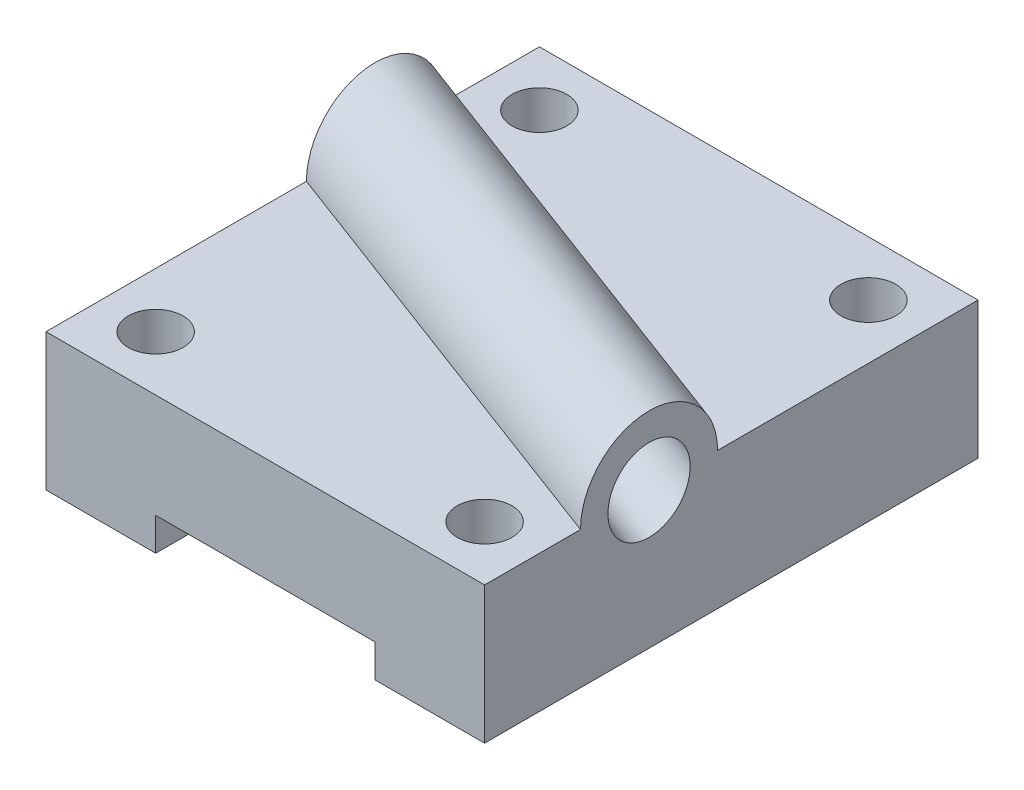
ISO-10303-21;
HEADER;
FILE_DESCRIPTION(('STEP AP214'),'2;1');
FILE_NAME('part.step','',(''),(''),'','','');
FILE_SCHEMA(('AUTOMOTIVE_DESIGN { 1 0 10303 214 1 1 1 1 }'));
ENDSEC;
DATA;
#1=APPLICATION_CONTEXT('core data for automotive mechanical design processes');
#2=APPLICATION_PROTOCOL_DEFINITION('international standard','automotive_design',2000,#1);
#3=PRODUCT_CONTEXT('',#1,'mechanical');
#4=PRODUCT('Part','Part','',(#3));
#5=PRODUCT_RELATED_PRODUCT_CATEGORY('part','',(#4));
#6=PRODUCT_DEFINITION_FORMATION('','',#4);
#7=PRODUCT_DEFINITION_CONTEXT('part definition',#1,'design');
#8=PRODUCT_DEFINITION('design','',#6,#7);
#9=PRODUCT_DEFINITION_SHAPE('','',#8);
#10=(LENGTH_UNIT() NAMED_UNIT(*) SI_UNIT(.MILLI.,.METRE.));
#11=(NAMED_UNIT(*) PLANE_ANGLE_UNIT() SI_UNIT($,.RADIAN.));
#12=(NAMED_UNIT(*) SI_UNIT($,.STERADIAN.) SOLID_ANGLE_UNIT());
#13=UNCERTAINTY_MEASURE_WITH_UNIT(LENGTH_MEASURE(1.E-05),#10,'distance_accuracy_value','');
#14=(GEOMETRIC_REPRESENTATION_CONTEXT(3) GLOBAL_UNCERTAINTY_ASSIGNED_CONTEXT((#13)) GLOBAL_UNIT_ASSIGNED_CONTEXT((#10,
#11,#12)) REPRESENTATION_CONTEXT('',''));
#15=CARTESIAN_POINT('',(0.,0.,0.));
#16=DIRECTION('',(0.,0.,1.));
#17=DIRECTION('',(1.,0.,0.));
#18=AXIS2_PLACEMENT_3D('',#15,#16,#17);
#19=CARTESIAN_POINT('',(0.,25.,-90.));
#20=DIRECTION('',(0.,1.,0.));
#21=DIRECTION('',(-1.,0.,0.));
#22=AXIS2_PLACEMENT_3D('',#19,#20,#21);
#23=PLANE('',#22);
#24=DIRECTION('',(-0.936329177569045,0.,-0.351123441588392));
#25=VECTOR('',#24,1.);
#26=CARTESIAN_POINT('',(-40.,25.,-57.5));
#27=LINE('',#26,#25);
#28=CARTESIAN_POINT('',(0.,25.,-42.5));
#29=VERTEX_POINT('',#28);
#30=CARTESIAN_POINT('',(-80.,25.,-72.5));
#31=VERTEX_POINT('',#30);
#32=EDGE_CURVE('E294',#29,#31,#27,.T.);
#33=ORIENTED_EDGE('',*,*,#32,.F.);
#34=DIRECTION('',(0.,0.,1.));
#35=VECTOR('',#34,1.);
#36=CARTESIAN_POINT('',(0.,25.,-90.));
#37=LINE('',#36,#35);
#38=CARTESIAN_POINT('',(0.,25.,-90.));
#39=VERTEX_POINT('',#38);
#40=EDGE_CURVE('E214',#39,#29,#37,.T.);
#41=ORIENTED_EDGE('',*,*,#40,.F.);
#42=DIRECTION('',(-1.,0.,0.));
#43=VECTOR('',#42,1.);
#44=CARTESIAN_POINT('',(0.,25.,-90.));
#45=LINE('',#44,#43);
#46=CARTESIAN_POINT('',(-80.,25.,-90.));
#47=VERTEX_POINT('',#46);
#48=EDGE_CURVE('E283',#39,#47,#45,.T.);
#49=ORIENTED_EDGE('',*,*,#48,.T.);
#50=DIRECTION('',(0.,0.,1.));
#51=VECTOR('',#50,1.);
#52=CARTESIAN_POINT('',(-80.,25.,-90.));
#53=LINE('',#52,#51);
#54=EDGE_CURVE('E200',#47,#31,#53,.T.);
#55=ORIENTED_EDGE('',*,*,#54,.T.);
#56=EDGE_LOOP('',(#33,#41,#49,#55));
#57=FACE_BOUND('',#56,.T.);
#58=CARTESIAN_POINT('',(-70.,25.,-80.));
#59=DIRECTION('',(0.,1.,0.));
#60=DIRECTION('',(-1.,0.,0.));
#61=AXIS2_PLACEMENT_3D('',#58,#59,#60);
#62=CIRCLE('',#61,5.00000000000001);
#63=CARTESIAN_POINT('',(-75.,25.,-80.));
#64=VERTEX_POINT('',#63);
#65=EDGE_CURVE('E177',#64,#64,#62,.T.);
#66=ORIENTED_EDGE('',*,*,#65,.F.);
#67=EDGE_LOOP('',(#66));
#68=FACE_BOUND('',#67,.T.);
#69=CARTESIAN_POINT('',(-10.,25.,-80.));
#70=DIRECTION('',(0.,1.,0.));
#71=DIRECTION('',(-1.,0.,0.));
#72=AXIS2_PLACEMENT_3D('',#69,#70,#71);
#73=CIRCLE('',#72,5.00000000000001);
#74=CARTESIAN_POINT('',(-15.,25.,-80.));
#75=VERTEX_POINT('',#74);
#76=EDGE_CURVE('E265',#75,#75,#73,.T.);
#77=ORIENTED_EDGE('',*,*,#76,.F.);
#78=EDGE_LOOP('',(#77));
#79=FACE_BOUND('',#78,.T.);
#80=ADVANCED_FACE('F61',(#57,#68,#79),#23,.T.);
#81=CARTESIAN_POINT('',(-20.,0.,-90.));
#82=DIRECTION('',(0.,-1.,0.));
#83=DIRECTION('',(0.,0.,-1.));
#84=AXIS2_PLACEMENT_3D('',#81,#82,#83);
#85=PLANE('',#84);
#86=CARTESIAN_POINT('',(-9.99999999999928,0.,-9.99999999999999));
#87=DIRECTION('',(0.,-1.,0.));
#88=DIRECTION('',(0.,0.,-1.));
#89=AXIS2_PLACEMENT_3D('',#86,#87,#88);
#90=CIRCLE('',#89,5.00000000000001);
#91=CARTESIAN_POINT('',(-9.99999999999928,0.,-15.));
#92=VERTEX_POINT('',#91);
#93=EDGE_CURVE('E262',#92,#92,#90,.F.);
#94=ORIENTED_EDGE('',*,*,#93,.T.);
#95=EDGE_LOOP('',(#94));
#96=FACE_BOUND('',#95,.T.);
#97=CARTESIAN_POINT('',(-10.,0.,-80.));
#98=DIRECTION('',(0.,-1.,0.));
#99=DIRECTION('',(0.,0.,-1.));
#100=AXIS2_PLACEMENT_3D('',#97,#98,#99);
#101=CIRCLE('',#100,5.00000000000001);
#102=CARTESIAN_POINT('',(-10.,0.,-85.));
#103=VERTEX_POINT('',#102);
#104=EDGE_CURVE('E261',#103,#103,#101,.F.);
#105=ORIENTED_EDGE('',*,*,#104,.T.);
#106=EDGE_LOOP('',(#105));
#107=FACE_BOUND('',#106,.T.);
#108=DIRECTION('',(1.,0.,0.));
#109=VECTOR('',#108,1.);
#110=CARTESIAN_POINT('',(-20.,0.,0.));
#111=LINE('',#110,#109);
#112=CARTESIAN_POINT('',(-20.,0.,0.));
#113=VERTEX_POINT('',#112);
#114=CARTESIAN_POINT('',(0.,0.,0.));
#115=VERTEX_POINT('',#114);
#116=EDGE_CURVE('E173',#113,#115,#111,.T.);
#117=ORIENTED_EDGE('',*,*,#116,.F.);
#118=DIRECTION('',(0.,0.,1.));
#119=VECTOR('',#118,1.);
#120=CARTESIAN_POINT('',(-20.,0.,-90.));
#121=LINE('',#120,#119);
#122=CARTESIAN_POINT('',(-20.,0.,-90.));
#123=VERTEX_POINT('',#122);
#124=EDGE_CURVE('E12',#123,#113,#121,.T.);
#125=ORIENTED_EDGE('',*,*,#124,.F.);
#126=DIRECTION('',(1.,0.,0.));
#127=VECTOR('',#126,1.);
#128=CARTESIAN_POINT('',(-20.,0.,-90.));
#129=LINE('',#128,#127);
#130=CARTESIAN_POINT('',(0.,0.,-90.));
#131=VERTEX_POINT('',#130);
#132=EDGE_CURVE('E194',#123,#131,#129,.T.);
#133=ORIENTED_EDGE('',*,*,#132,.T.);
#134=DIRECTION('',(0.,0.,1.));
#135=VECTOR('',#134,1.);
#136=CARTESIAN_POINT('',(0.,0.,-90.));
#137=LINE('',#136,#135);
#138=EDGE_CURVE('E125',#131,#115,#137,.T.);
#139=ORIENTED_EDGE('',*,*,#138,.T.);
#140=EDGE_LOOP('',(#117,#125,#133,#139));
#141=FACE_BOUND('',#140,.T.);
#142=ADVANCED_FACE('F63',(#96,#107,#141),#85,.T.);
#143=CARTESIAN_POINT('',(-20.,6.,-90.));
#144=DIRECTION('',(-1.,0.,0.));
#145=DIRECTION('',(0.,-1.,0.));
#146=AXIS2_PLACEMENT_3D('',#143,#144,#145);
#147=PLANE('',#146);
#148=DIRECTION('',(0.,-1.,0.));
#149=VECTOR('',#148,1.);
#150=CARTESIAN_POINT('',(-20.,6.,0.));
#151=LINE('',#150,#149);
#152=CARTESIAN_POINT('',(-20.,6.,0.));
#153=VERTEX_POINT('',#152);
#154=EDGE_CURVE('E192',#153,#113,#151,.T.);
#155=ORIENTED_EDGE('',*,*,#154,.F.);
#156=DIRECTION('',(0.,0.,1.));
#157=VECTOR('',#156,1.);
#158=CARTESIAN_POINT('',(-20.,6.,-90.));
#159=LINE('',#158,#157);
#160=CARTESIAN_POINT('',(-20.,6.,-90.));
#161=VERTEX_POINT('',#160);
#162=EDGE_CURVE('E72',#161,#153,#159,.T.);
#163=ORIENTED_EDGE('',*,*,#162,.F.);
#164=DIRECTION('',(0.,-1.,0.));
#165=VECTOR('',#164,1.);
#166=CARTESIAN_POINT('',(-20.,6.,-90.));
#167=LINE('',#166,#165);
#168=EDGE_CURVE('E163',#161,#123,#167,.T.);
#169=ORIENTED_EDGE('',*,*,#168,.T.);
#170=ORIENTED_EDGE('',*,*,#124,.T.);
#171=EDGE_LOOP('',(#155,#163,#169,#170));
#172=FACE_BOUND('',#171,.T.);
#173=ADVANCED_FACE('F220',(#172),#147,.T.);
#174=CARTESIAN_POINT('',(-60.,6.,-90.));
#175=DIRECTION('',(0.,-1.,0.));
#176=DIRECTION('',(0.,0.,-1.));
#177=AXIS2_PLACEMENT_3D('',#174,#175,#176);
#178=PLANE('',#177);
#179=DIRECTION('',(1.,0.,0.));
#180=VECTOR('',#179,1.);
#181=CARTESIAN_POINT('',(-60.,6.,0.));
#182=LINE('',#181,#180);
#183=CARTESIAN_POINT('',(-60.,6.,0.));
#184=VERTEX_POINT('',#183);
#185=EDGE_CURVE('E150',#184,#153,#182,.T.);
#186=ORIENTED_EDGE('',*,*,#185,.F.);
#187=DIRECTION('',(0.,0.,1.));
#188=VECTOR('',#187,1.);
#189=CARTESIAN_POINT('',(-60.,6.,-90.));
#190=LINE('',#189,#188);
#191=CARTESIAN_POINT('',(-60.,6.,-90.));
#192=VERTEX_POINT('',#191);
#193=EDGE_CURVE('E144',#192,#184,#190,.T.);
#194=ORIENTED_EDGE('',*,*,#193,.F.);
#195=DIRECTION('',(1.,0.,0.));
#196=VECTOR('',#195,1.);
#197=CARTESIAN_POINT('',(-60.,6.,-90.));
#198=LINE('',#197,#196);
#199=EDGE_CURVE('E147',#192,#161,#198,.T.);
#200=ORIENTED_EDGE('',*,*,#199,.T.);
#201=ORIENTED_EDGE('',*,*,#162,.T.);
#202=EDGE_LOOP('',(#186,#194,#200,#201));
#203=FACE_BOUND('',#202,.T.);
#204=ADVANCED_FACE('F146',(#203),#178,.T.);
#205=CARTESIAN_POINT('',(-60.,0.,-90.));
#206=DIRECTION('',(1.,0.,0.));
#207=DIRECTION('',(0.,1.,0.));
#208=AXIS2_PLACEMENT_3D('',#205,#206,#207);
#209=PLANE('',#208);
#210=DIRECTION('',(0.,1.,0.));
#211=VECTOR('',#210,1.);
#212=CARTESIAN_POINT('',(-60.,0.,0.));
#213=LINE('',#212,#211);
#214=CARTESIAN_POINT('',(-60.,0.,0.));
#215=VERTEX_POINT('',#214);
#216=EDGE_CURVE('E189',#215,#184,#213,.T.);
#217=ORIENTED_EDGE('',*,*,#216,.F.);
#218=DIRECTION('',(0.,0.,1.));
#219=VECTOR('',#218,1.);
#220=CARTESIAN_POINT('',(-60.,0.,-90.));
#221=LINE('',#220,#219);
#222=CARTESIAN_POINT('',(-60.,0.,-90.));
#223=VERTEX_POINT('',#222);
#224=EDGE_CURVE('E155',#223,#215,#221,.T.);
#225=ORIENTED_EDGE('',*,*,#224,.F.);
#226=DIRECTION('',(0.,1.,0.));
#227=VECTOR('',#226,1.);
#228=CARTESIAN_POINT('',(-60.,0.,-90.));
#229=LINE('',#228,#227);
#230=EDGE_CURVE('E161',#223,#192,#229,.T.);
#231=ORIENTED_EDGE('',*,*,#230,.T.);
#232=ORIENTED_EDGE('',*,*,#193,.T.);
#233=EDGE_LOOP('',(#217,#225,#231,#232));
#234=FACE_BOUND('',#233,.T.);
#235=ADVANCED_FACE('F165',(#234),#209,.T.);
#236=CARTESIAN_POINT('',(-80.,0.,-90.));
#237=DIRECTION('',(0.,-1.,0.));
#238=DIRECTION('',(0.,0.,-1.));
#239=AXIS2_PLACEMENT_3D('',#236,#237,#238);
#240=PLANE('',#239);
#241=CARTESIAN_POINT('',(-69.9999999999993,0.,-9.99999999999999));
#242=DIRECTION('',(0.,-1.,0.));
#243=DIRECTION('',(0.,0.,-1.));
#244=AXIS2_PLACEMENT_3D('',#241,#242,#243);
#245=CIRCLE('',#244,5.);
#246=CARTESIAN_POINT('',(-69.9999999999993,0.,-15.));
#247=VERTEX_POINT('',#246);
#248=EDGE_CURVE('E272',#247,#247,#245,.F.);
#249=ORIENTED_EDGE('',*,*,#248,.T.);
#250=EDGE_LOOP('',(#249));
#251=FACE_BOUND('',#250,.T.);
#252=CARTESIAN_POINT('',(-70.,0.,-80.));
#253=DIRECTION('',(0.,-1.,0.));
#254=DIRECTION('',(0.,0.,-1.));
#255=AXIS2_PLACEMENT_3D('',#252,#253,#254);
#256=CIRCLE('',#255,5.00000000000001);
#257=CARTESIAN_POINT('',(-70.,0.,-85.));
#258=VERTEX_POINT('',#257);
#259=EDGE_CURVE('E277',#258,#258,#256,.F.);
#260=ORIENTED_EDGE('',*,*,#259,.T.);
#261=EDGE_LOOP('',(#260));
#262=FACE_BOUND('',#261,.T.);
#263=DIRECTION('',(1.,0.,0.));
#264=VECTOR('',#263,1.);
#265=CARTESIAN_POINT('',(-80.,0.,0.));
#266=LINE('',#265,#264);
#267=CARTESIAN_POINT('',(-80.,0.,0.));
#268=VERTEX_POINT('',#267);
#269=EDGE_CURVE('E186',#268,#215,#266,.T.);
#270=ORIENTED_EDGE('',*,*,#269,.F.);
#271=DIRECTION('',(0.,0.,1.));
#272=VECTOR('',#271,1.);
#273=CARTESIAN_POINT('',(-80.,0.,-90.));
#274=LINE('',#273,#272);
#275=CARTESIAN_POINT('',(-80.,0.,-90.));
#276=VERTEX_POINT('',#275);
#277=EDGE_CURVE('E198',#276,#268,#274,.T.);
#278=ORIENTED_EDGE('',*,*,#277,.F.);
#279=DIRECTION('',(1.,0.,0.));
#280=VECTOR('',#279,1.);
#281=CARTESIAN_POINT('',(-80.,0.,-90.));
#282=LINE('',#281,#280);
#283=EDGE_CURVE('E166',#276,#223,#282,.T.);
#284=ORIENTED_EDGE('',*,*,#283,.T.);
#285=ORIENTED_EDGE('',*,*,#224,.T.);
#286=EDGE_LOOP('',(#270,#278,#284,#285));
#287=FACE_BOUND('',#286,.T.);
#288=ADVANCED_FACE('F246',(#251,#262,#287),#240,.T.);
#289=CARTESIAN_POINT('',(-80.,25.,-90.));
#290=DIRECTION('',(-1.,0.,0.));
#291=DIRECTION('',(0.,0.,1.));
#292=AXIS2_PLACEMENT_3D('',#289,#290,#291);
#293=PLANE('',#292);
#294=CARTESIAN_POINT('',(-80.,25.,-60.));
#295=DIRECTION('',(-1.,0.,0.));
#296=DIRECTION('',(0.,0.,1.));
#297=AXIS2_PLACEMENT_3D('',#294,#295,#296);
#298=CIRCLE('',#297,7.5);
#299=CARTESIAN_POINT('',(-80.,27.8178004996124,-66.950539572176));
#300=VERTEX_POINT('',#299);
#301=EDGE_CURVE('E489',#300,#300,#298,.T.);
#302=ORIENTED_EDGE('',*,*,#301,.F.);
#303=EDGE_LOOP('',(#302));
#304=FACE_BOUND('',#303,.T.);
#305=DIRECTION('',(0.,-1.,0.));
#306=VECTOR('',#305,1.);
#307=CARTESIAN_POINT('',(-80.,25.,0.));
#308=LINE('',#307,#306);
#309=CARTESIAN_POINT('',(-80.,25.,0.));
#310=VERTEX_POINT('',#309);
#311=EDGE_CURVE('E183',#310,#268,#308,.T.);
#312=ORIENTED_EDGE('',*,*,#311,.F.);
#313=CARTESIAN_POINT('',(-80.,25.,-47.5));
#314=VERTEX_POINT('',#313);
#315=EDGE_CURVE('E207',#314,#310,#53,.T.);
#316=ORIENTED_EDGE('',*,*,#315,.F.);
#317=CARTESIAN_POINT('',(-80.,25.,-60.));
#318=DIRECTION('',(-1.,0.,0.));
#319=DIRECTION('',(0.,0.,1.));
#320=AXIS2_PLACEMENT_3D('',#317,#318,#319);
#321=CIRCLE('',#320,12.5);
#322=EDGE_CURVE('E298',#314,#31,#321,.T.);
#323=ORIENTED_EDGE('',*,*,#322,.T.);
#324=ORIENTED_EDGE('',*,*,#54,.F.);
#325=DIRECTION('',(0.,-1.,0.));
#326=VECTOR('',#325,1.);
#327=CARTESIAN_POINT('',(-80.,25.,-90.));
#328=LINE('',#327,#326);
#329=EDGE_CURVE('E168',#47,#276,#328,.T.);
#330=ORIENTED_EDGE('',*,*,#329,.T.);
#331=ORIENTED_EDGE('',*,*,#277,.T.);
#332=EDGE_LOOP('',(#312,#316,#323,#324,#330,#331));
#333=FACE_BOUND('',#332,.T.);
#334=ADVANCED_FACE('F239',(#304,#333),#293,.T.);
#335=DIRECTION('',(0.936329177569045,0.,0.351123441588392));
#336=VECTOR('',#335,1.);
#337=CARTESIAN_POINT('',(-40.,25.,-32.5));
#338=LINE('',#337,#336);
#339=CARTESIAN_POINT('',(0.,25.,-17.5000000000001));
#340=VERTEX_POINT('',#339);
#341=EDGE_CURVE('E251',#314,#340,#338,.T.);
#342=ORIENTED_EDGE('',*,*,#341,.F.);
#343=ORIENTED_EDGE('',*,*,#315,.T.);
#344=DIRECTION('',(-1.,0.,0.));
#345=VECTOR('',#344,1.);
#346=CARTESIAN_POINT('',(0.,25.,0.));
#347=LINE('',#346,#345);
#348=CARTESIAN_POINT('',(0.,25.,0.));
#349=VERTEX_POINT('',#348);
#350=EDGE_CURVE('E180',#349,#310,#347,.T.);
#351=ORIENTED_EDGE('',*,*,#350,.F.);
#352=EDGE_CURVE('E212',#340,#349,#37,.T.);
#353=ORIENTED_EDGE('',*,*,#352,.F.);
#354=EDGE_LOOP('',(#342,#343,#351,#353));
#355=FACE_BOUND('',#354,.T.);
#356=CARTESIAN_POINT('',(-69.9999999999993,25.,-9.99999999999999));
#357=DIRECTION('',(0.,1.,0.));
#358=DIRECTION('',(-1.,0.,0.));
#359=AXIS2_PLACEMENT_3D('',#356,#357,#358);
#360=CIRCLE('',#359,5.);
#361=CARTESIAN_POINT('',(-74.9999999999993,25.,-9.99999999999999));
#362=VERTEX_POINT('',#361);
#363=EDGE_CURVE('E256',#362,#362,#360,.T.);
#364=ORIENTED_EDGE('',*,*,#363,.F.);
#365=EDGE_LOOP('',(#364));
#366=FACE_BOUND('',#365,.T.);
#367=CARTESIAN_POINT('',(-9.99999999999928,25.,-9.99999999999999));
#368=DIRECTION('',(0.,1.,0.));
#369=DIRECTION('',(-1.,0.,0.));
#370=AXIS2_PLACEMENT_3D('',#367,#368,#369);
#371=CIRCLE('',#370,5.00000000000001);
#372=CARTESIAN_POINT('',(-14.9999999999993,25.,-9.99999999999999));
#373=VERTEX_POINT('',#372);
#374=EDGE_CURVE('E259',#373,#373,#371,.T.);
#375=ORIENTED_EDGE('',*,*,#374,.F.);
#376=EDGE_LOOP('',(#375));
#377=FACE_BOUND('',#376,.T.);
#378=ADVANCED_FACE('F233',(#355,#366,#377),#23,.T.);
#379=CARTESIAN_POINT('',(0.,0.,-90.));
#380=DIRECTION('',(1.,0.,0.));
#381=DIRECTION('',(0.,0.,-1.));
#382=AXIS2_PLACEMENT_3D('',#379,#380,#381);
#383=PLANE('',#382);
#384=CARTESIAN_POINT('',(0.,25.,-30.));
#385=DIRECTION('',(1.,0.,0.));
#386=DIRECTION('',(0.,0.,-1.));
#387=AXIS2_PLACEMENT_3D('',#384,#385,#386);
#388=CIRCLE('',#387,7.5);
#389=CARTESIAN_POINT('',(0.,31.3775039210982,-33.9468270466765));
#390=VERTEX_POINT('',#389);
#391=EDGE_CURVE('E304',#390,#390,#388,.T.);
#392=ORIENTED_EDGE('',*,*,#391,.F.);
#393=EDGE_LOOP('',(#392));
#394=FACE_BOUND('',#393,.T.);
#395=DIRECTION('',(0.,1.,0.));
#396=VECTOR('',#395,1.);
#397=CARTESIAN_POINT('',(0.,0.,0.));
#398=LINE('',#397,#396);
#399=EDGE_CURVE('E176',#115,#349,#398,.T.);
#400=ORIENTED_EDGE('',*,*,#399,.F.);
#401=ORIENTED_EDGE('',*,*,#138,.F.);
#402=DIRECTION('',(0.,1.,0.));
#403=VECTOR('',#402,1.);
#404=CARTESIAN_POINT('',(0.,0.,-90.));
#405=LINE('',#404,#403);
#406=EDGE_CURVE('E281',#131,#39,#405,.T.);
#407=ORIENTED_EDGE('',*,*,#406,.T.);
#408=ORIENTED_EDGE('',*,*,#40,.T.);
#409=CARTESIAN_POINT('',(0.,25.,-30.));
#410=DIRECTION('',(1.,0.,0.));
#411=DIRECTION('',(0.,0.,-1.));
#412=AXIS2_PLACEMENT_3D('',#409,#410,#411);
#413=CIRCLE('',#412,12.5);
#414=EDGE_CURVE('E80',#29,#340,#413,.T.);
#415=ORIENTED_EDGE('',*,*,#414,.T.);
#416=ORIENTED_EDGE('',*,*,#352,.T.);
#417=EDGE_LOOP('',(#400,#401,#407,#408,#415,#416));
#418=FACE_BOUND('',#417,.T.);
#419=ADVANCED_FACE('F215',(#394,#418),#383,.T.);
#420=CARTESIAN_POINT('',(0.,0.,-90.));
#421=DIRECTION('',(0.,0.,1.));
#422=DIRECTION('',(1.,0.,0.));
#423=AXIS2_PLACEMENT_3D('',#420,#421,#422);
#424=PLANE('',#423);
#425=ORIENTED_EDGE('',*,*,#132,.F.);
#426=ORIENTED_EDGE('',*,*,#168,.F.);
#427=ORIENTED_EDGE('',*,*,#199,.F.);
#428=ORIENTED_EDGE('',*,*,#230,.F.);
#429=ORIENTED_EDGE('',*,*,#283,.F.);
#430=ORIENTED_EDGE('',*,*,#329,.F.);
#431=ORIENTED_EDGE('',*,*,#48,.F.);
#432=ORIENTED_EDGE('',*,*,#406,.F.);
#433=EDGE_LOOP('',(#425,#426,#427,#428,#429,#430,#431,#432));
#434=FACE_BOUND('',#433,.T.);
#435=ADVANCED_FACE('F159',(#434),#424,.F.);
#436=CARTESIAN_POINT('',(0.,0.,0.));
#437=DIRECTION('',(0.,0.,1.));
#438=DIRECTION('',(1.,0.,0.));
#439=AXIS2_PLACEMENT_3D('',#436,#437,#438);
#440=PLANE('',#439);
#441=ORIENTED_EDGE('',*,*,#116,.T.);
#442=ORIENTED_EDGE('',*,*,#399,.T.);
#443=ORIENTED_EDGE('',*,*,#350,.T.);
#444=ORIENTED_EDGE('',*,*,#311,.T.);
#445=ORIENTED_EDGE('',*,*,#269,.T.);
#446=ORIENTED_EDGE('',*,*,#216,.T.);
#447=ORIENTED_EDGE('',*,*,#185,.T.);
#448=ORIENTED_EDGE('',*,*,#154,.T.);
#449=EDGE_LOOP('',(#441,#442,#443,#444,#445,#446,#447,#448));
#450=FACE_BOUND('',#449,.T.);
#451=ADVANCED_FACE('F219',(#450),#440,.T.);
#452=CARTESIAN_POINT('',(-70.,-0.00100000000001141,-80.));
#453=DIRECTION('',(0.,1.,0.));
#454=DIRECTION('',(-1.,0.,0.));
#455=AXIS2_PLACEMENT_3D('',#452,#453,#454);
#456=CYLINDRICAL_SURFACE('',#455,5.00000000000001);
#457=ORIENTED_EDGE('',*,*,#259,.F.);
#458=EDGE_LOOP('',(#457));
#459=FACE_BOUND('',#458,.T.);
#460=ORIENTED_EDGE('',*,*,#65,.T.);
#461=EDGE_LOOP('',(#460));
#462=FACE_BOUND('',#461,.T.);
#463=ADVANCED_FACE('F393',(#459,#462),#456,.F.);
#464=CARTESIAN_POINT('',(-10.,-0.001000000000001,-80.));
#465=DIRECTION('',(0.,1.,0.));
#466=DIRECTION('',(-1.,0.,0.));
#467=AXIS2_PLACEMENT_3D('',#464,#465,#466);
#468=CYLINDRICAL_SURFACE('',#467,5.00000000000001);
#469=ORIENTED_EDGE('',*,*,#104,.F.);
#470=EDGE_LOOP('',(#469));
#471=FACE_BOUND('',#470,.T.);
#472=ORIENTED_EDGE('',*,*,#76,.T.);
#473=EDGE_LOOP('',(#472));
#474=FACE_BOUND('',#473,.T.);
#475=ADVANCED_FACE('F385',(#471,#474),#468,.F.);
#476=CARTESIAN_POINT('',(-9.99999999999928,-0.001000000000001,-9.99999999999999));
#477=DIRECTION('',(0.,1.,0.));
#478=DIRECTION('',(-1.,0.,0.));
#479=AXIS2_PLACEMENT_3D('',#476,#477,#478);
#480=CYLINDRICAL_SURFACE('',#479,5.00000000000001);
#481=ORIENTED_EDGE('',*,*,#93,.F.);
#482=EDGE_LOOP('',(#481));
#483=FACE_BOUND('',#482,.T.);
#484=ORIENTED_EDGE('',*,*,#374,.T.);
#485=EDGE_LOOP('',(#484));
#486=FACE_BOUND('',#485,.T.);
#487=ADVANCED_FACE('F377',(#483,#486),#480,.F.);
#488=CARTESIAN_POINT('',(-69.9999999999993,-0.00100000000001141,-9.99999999999999));
#489=DIRECTION('',(0.,1.,0.));
#490=DIRECTION('',(-1.,0.,0.));
#491=AXIS2_PLACEMENT_3D('',#488,#489,#490);
#492=CYLINDRICAL_SURFACE('',#491,5.);
#493=ORIENTED_EDGE('',*,*,#248,.F.);
#494=EDGE_LOOP('',(#493));
#495=FACE_BOUND('',#494,.T.);
#496=ORIENTED_EDGE('',*,*,#363,.T.);
#497=EDGE_LOOP('',(#496));
#498=FACE_BOUND('',#497,.T.);
#499=ADVANCED_FACE('F372',(#495,#498),#492,.F.);
#500=CARTESIAN_POINT('',(-80.,25.,-72.5));
#501=CARTESIAN_POINT('',(0.,25.,-42.5));
#502=CARTESIAN_POINT('',(-80.,25.5208333333333,-72.5));
#503=CARTESIAN_POINT('',(0.,25.5208333333333,-42.5));
#504=CARTESIAN_POINT('',(-80.,26.0745425118125,-72.4676951993108));
#505=CARTESIAN_POINT('',(0.,26.0745425118125,-42.4676951993108));
#506=CARTESIAN_POINT('',(-80.,27.244041558984,-72.3110658626361));
#507=CARTESIAN_POINT('',(0.,27.244041558984,-42.3110658626361));
#508=CARTESIAN_POINT('',(-80.,27.86,-72.1866666666667));
#509=CARTESIAN_POINT('',(0.,27.86,-42.1866666666667));
#510=CARTESIAN_POINT('',(-80.,29.14,-71.8133333333334));
#511=CARTESIAN_POINT('',(0.,29.14,-41.8133333333333));
#512=CARTESIAN_POINT('',(-80.,29.8042124310903,-71.5641964398435));
#513=CARTESIAN_POINT('',(0.,29.8042124310903,-41.5641964398435));
#514=CARTESIAN_POINT('',(-80.,31.1508437486849,-70.9077136725161));
#515=CARTESIAN_POINT('',(0.,31.1508437486849,-40.9077136725161));
#516=CARTESIAN_POINT('',(-80.,31.8333333333333,-70.5));
#517=CARTESIAN_POINT('',(0.,31.8333333333333,-40.5));
#518=CARTESIAN_POINT('',(-80.,33.1666666666667,-69.5));
#519=CARTESIAN_POINT('',(0.,33.1666666666667,-39.5));
#520=CARTESIAN_POINT('',(-80.,33.8173203227622,-68.9072371301683));
#521=CARTESIAN_POINT('',(0.,33.8173203227622,-38.9072371301683));
#522=CARTESIAN_POINT('',(-80.,35.0182961155939,-67.5311190342153));
#523=CARTESIAN_POINT('',(0.,35.0182961155939,-37.5311190342153));
#524=CARTESIAN_POINT('',(-80.,35.5680507497116,-66.7474048442906));
#525=CARTESIAN_POINT('',(0.,35.5680507497117,-36.7474048442907));
#526=CARTESIAN_POINT('',(-80.,36.4907727797001,-65.0173010380623));
#527=CARTESIAN_POINT('',(0.,36.4907727797001,-35.0173010380623));
#528=CARTESIAN_POINT('',(-80.,36.8629191321499,-64.0710059171598));
#529=CARTESIAN_POINT('',(0.,36.8629191321499,-34.0710059171598));
#530=CARTESIAN_POINT('',(-80.,37.3678500986193,-62.0828402366864));
#531=CARTESIAN_POINT('',(0.,37.3678500986193,-32.0828402366864));
#532=CARTESIAN_POINT('',(-80.,37.5,-61.0416666666667));
#533=CARTESIAN_POINT('',(0.,37.5,-31.0416666666667));
#534=CARTESIAN_POINT('',(-80.,37.5,-58.9583333333333));
#535=CARTESIAN_POINT('',(0.,37.5,-28.9583333333333));
#536=CARTESIAN_POINT('',(-80.,37.3678500986193,-57.9171597633136));
#537=CARTESIAN_POINT('',(0.,37.3678500986193,-27.9171597633136));
#538=CARTESIAN_POINT('',(-80.,36.8629191321499,-55.9289940828402));
#539=CARTESIAN_POINT('',(0.,36.8629191321499,-25.9289940828402));
#540=CARTESIAN_POINT('',(-80.,36.4907727797001,-54.9826989619377));
#541=CARTESIAN_POINT('',(0.,36.4907727797001,-24.9826989619377));
#542=CARTESIAN_POINT('',(-80.,35.5680507497116,-53.2525951557093));
#543=CARTESIAN_POINT('',(0.,35.5680507497117,-23.2525951557094));
#544=CARTESIAN_POINT('',(-80.,35.0182961155939,-52.4688809657847));
#545=CARTESIAN_POINT('',(0.,35.0182961155939,-22.4688809657847));
#546=CARTESIAN_POINT('',(-80.,33.8173203227622,-51.0927628698317));
#547=CARTESIAN_POINT('',(0.,33.8173203227622,-21.0927628698317));
#548=CARTESIAN_POINT('',(-80.,33.1666666666667,-50.5));
#549=CARTESIAN_POINT('',(0.,33.1666666666667,-20.5));
#550=CARTESIAN_POINT('',(-80.,31.8333333333333,-49.5));
#551=CARTESIAN_POINT('',(0.,31.8333333333333,-19.5));
#552=CARTESIAN_POINT('',(-80.,31.1508437486849,-49.0922863274839));
#553=CARTESIAN_POINT('',(0.,31.1508437486849,-19.0922863274839));
#554=CARTESIAN_POINT('',(-80.,29.8042124310903,-48.4358035601565));
#555=CARTESIAN_POINT('',(0.,29.8042124310904,-18.4358035601566));
#556=CARTESIAN_POINT('',(-80.,29.14,-48.1866666666667));
#557=CARTESIAN_POINT('',(0.,29.14,-18.1866666666667));
#558=CARTESIAN_POINT('',(-80.,27.86,-47.8133333333333));
#559=CARTESIAN_POINT('',(0.,27.86,-17.8133333333333));
#560=CARTESIAN_POINT('',(-80.,27.244041558984,-47.6889341373639));
#561=CARTESIAN_POINT('',(0.,27.244041558984,-17.6889341373639));
#562=CARTESIAN_POINT('',(-80.,26.0745425118125,-47.5323048006892));
#563=CARTESIAN_POINT('',(0.,26.0745425118125,-17.5323048006892));
#564=CARTESIAN_POINT('',(-80.,25.5208333333333,-47.5));
#565=CARTESIAN_POINT('',(0.,25.5208333333333,-17.5));
#566=CARTESIAN_POINT('',(-80.,25.,-47.5));
#567=CARTESIAN_POINT('',(0.,25.,-17.5));
#568=B_SPLINE_SURFACE_WITH_KNOTS('',3,1,((#500,#501),(#502,#503),(#504,#505),(#506,#507),(#508,
#509),(#510,#511),(#512,#513),(#514,#515),(#516,#517),(#518,#519),(#520,#521),(#522,#523),(#524,
#525),(#526,#527),(#528,#529),(#530,#531),(#532,#533),(#534,#535),(#536,#537),(#538,#539),(#540,
#541),(#542,#543),(#544,#545),(#546,#547),(#548,#549),(#550,#551),(#552,#553),(#554,#555),(#556,
#557),(#558,#559),(#560,#561),(#562,#563),(#564,#565),(#566,#567)),.UNSPECIFIED.,.F.,.F.,.F.,(4,
2,2,2,2,2,2,2,2,2,2,2,2,2,2,2,4),(2,2),(0.,0.0624999999999998,0.125,0.187499999999999,
0.249999999999999,0.312499999999999,0.374999999999999,0.437499999999998,0.499999999999998,
0.562499999999999,0.624999999999999,0.687499999999999,0.749999999999999,0.812499999999999,0.875,
0.9375,1.),(0.,1.),.UNSPECIFIED.);
#569=ORIENTED_EDGE('',*,*,#322,.F.);
#570=ORIENTED_EDGE('',*,*,#341,.T.);
#571=ORIENTED_EDGE('',*,*,#414,.F.);
#572=ORIENTED_EDGE('',*,*,#32,.T.);
#573=EDGE_LOOP('',(#569,#570,#571,#572));
#574=FACE_BOUND('',#573,.T.);
#575=ADVANCED_FACE('F301',(#574),#568,.T.);
#576=CARTESIAN_POINT('',(-80.,27.8178004996124,-66.950539572176));
#577=CARTESIAN_POINT('',(0.,31.3775039210982,-33.9468270466765));
#578=CARTESIAN_POINT('',(-80.,28.3970121306271,-66.7157228638749));
#579=CARTESIAN_POINT('',(0.,31.7064061749879,-33.415368386585));
#580=CARTESIAN_POINT('',(-80.0000000000001,29.0236626159015,-66.3796660691134));
#581=CARTESIAN_POINT('',(0.,32.0138350315209,-32.7741878362165));
#582=CARTESIAN_POINT('',(-80.,29.9650280318051,-65.6354677395395));
#583=CARTESIAN_POINT('',(0.,32.3343554902251,-31.6177853822447));
#584=CARTESIAN_POINT('',(-80.,30.2781973696992,-65.3472074229582));
#585=CARTESIAN_POINT('',(0.,32.4169682960367,-31.2002399731829));
#586=CARTESIAN_POINT('',(-80.,30.8789955130841,-64.6786115947764));
#587=CARTESIAN_POINT('',(0.,32.5072242547103,-30.3059063371831));
#588=CARTESIAN_POINT('',(-80.,31.1665807191306,-64.298055634173));
#589=CARTESIAN_POINT('',(0.,32.514702079239,-29.8289659090079));
#590=CARTESIAN_POINT('',(-80.,31.6825475668604,-63.4414470817736));
#591=CARTESIAN_POINT('',(0.,32.42549665053,-28.8329526603566));
#592=CARTESIAN_POINT('',(-80.,31.9107160847572,-62.9651723633014));
#593=CARTESIAN_POINT('',(0.,32.328510244231,-28.3138263587611));
#594=CARTESIAN_POINT('',(-80.,32.2683003659572,-61.9292624856236));
#595=CARTESIAN_POINT('',(0.,32.0056178593284,-27.2665841228846));
#596=CARTESIAN_POINT('',(-80.,32.3973196542371,-61.3695556557814));
#597=CARTESIAN_POINT('',(0.,31.779349550505,-26.7386443871737));
#598=CARTESIAN_POINT('',(-80.,32.5203859433556,-60.19953953048));
#599=CARTESIAN_POINT('',(0.,31.1879959870165,-25.7215976783485));
#600=CARTESIAN_POINT('',(-80.,32.5139977101463,-59.5894678614678));
#601=CARTESIAN_POINT('',(0.,30.8226997026245,-25.2329394384056));
#602=CARTESIAN_POINT('',(-80.,32.3465807834193,-58.370138344047));
#603=CARTESIAN_POINT('',(0.,29.9677669643968,-24.3475678144448));
#604=CARTESIAN_POINT('',(-80.,32.185356280477,-57.7614111314023));
#605=CARTESIAN_POINT('',(0.,29.478285706768,-23.9513983327915));
#606=CARTESIAN_POINT('',(-80.,31.7157228638749,-56.6029878693729));
#607=CARTESIAN_POINT('',(0.,28.415368386585,-23.2935938250121));
#608=CARTESIAN_POINT('',(-80.,31.4075362618917,-56.0538401860296));
#609=CARTESIAN_POINT('',(0.,27.8424354801586,-23.0322701856352));
#610=CARTESIAN_POINT('',(-80.,30.6785925089786,-55.0621578253428));
#611=CARTESIAN_POINT('',(0.,26.6686427107044,-22.6621304366414));
#612=CARTESIAN_POINT('',(-80.,30.2583454038744,-54.6198676247885));
#613=CARTESIAN_POINT('',(0.,26.068338860045,-22.5532105682137));
#614=CARTESIAN_POINT('',(-80.,29.3552651356244,-53.8658589550239));
#615=CARTESIAN_POINT('',(0.,24.8942934142329,-22.4777099976821));
#616=CARTESIAN_POINT('',(-80.,28.8729098095968,-53.5540079464106));
#617=CARTESIAN_POINT('',(0.,24.320859271974,-22.5107402355277));
#618=CARTESIAN_POINT('',(-80.,27.8949053270685,-53.0595556989831));
#619=CARTESIAN_POINT('',(0.,23.2395598884231,-22.6889744521197));
#620=CARTESIAN_POINT('',(-80.,27.3994908074495,-52.8766269320661));
#621=CARTESIAN_POINT('',(0.,22.7316906904607,-22.8337755494084));
#622=CARTESIAN_POINT('',(-80.,26.4326758797817,-52.6211491529174));
#623=CARTESIAN_POINT('',(0.,21.800495491794,-23.1982964705914));
#624=CARTESIAN_POINT('',(-80.,25.9612737473168,-52.5482923111304));
#625=CARTESIAN_POINT('',(0.,21.3769863800402,-23.4177688427688));
#626=CARTESIAN_POINT('',(-80.,25.0645016087701,-52.4868226268705));
#627=CARTESIAN_POINT('',(0.,20.6168549937244,-23.8975386480863));
#628=CARTESIAN_POINT('',(-80.,24.6390093808043,-52.4980212095173));
#629=CARTESIAN_POINT('',(0.,20.2800227454934,-24.1577560204199));
#630=CARTESIAN_POINT('',(-80.0000000000001,23.4451690401354,-52.6194511934243));
#631=CARTESIAN_POINT('',(0.,19.3880779354587,-24.9605227710095));
#632=CARTESIAN_POINT('',(-80.,22.7614111314022,-52.814643719523));
#633=CARTESIAN_POINT('',(0.,18.9513983327915,-25.521714293232));
#634=CARTESIAN_POINT('',(-80.,21.6029878693729,-53.2842771361251));
#635=CARTESIAN_POINT('',(0.,18.2935938250121,-26.584631613415));
#636=CARTESIAN_POINT('',(-80.,20.9763373840985,-53.6203339308866));
#637=CARTESIAN_POINT('',(0.,17.9861649684792,-27.2258121637835));
#638=CARTESIAN_POINT('',(-80.,20.0349719681949,-54.3645322604606));
#639=CARTESIAN_POINT('',(0.,17.6656445097749,-28.3822146177553));
#640=CARTESIAN_POINT('',(-80.0000000000001,19.7218026303008,-54.6527925770418));
#641=CARTESIAN_POINT('',(0.,17.5830317039633,-28.7997600268171));
#642=CARTESIAN_POINT('',(-80.,19.1210044869159,-55.3213884052236));
#643=CARTESIAN_POINT('',(0.,17.4927757452897,-29.6940936628169));
#644=CARTESIAN_POINT('',(-80.0000000000001,18.8334192808694,-55.701944365827));
#645=CARTESIAN_POINT('',(0.,17.485297920761,-30.1710340909921));
#646=CARTESIAN_POINT('',(-80.,18.3174524331396,-56.5585529182264));
#647=CARTESIAN_POINT('',(0.,17.5745033494701,-31.1670473396434));
#648=CARTESIAN_POINT('',(-80.,18.0892839152428,-57.0348276366986));
#649=CARTESIAN_POINT('',(0.,17.671489755769,-31.6861736412389));
#650=CARTESIAN_POINT('',(-80.,17.7316996340428,-58.0707375143764));
#651=CARTESIAN_POINT('',(0.,17.9943821406716,-32.7334158771154));
#652=CARTESIAN_POINT('',(-80.,17.6026803457629,-58.6304443442186));
#653=CARTESIAN_POINT('',(0.,18.220650449495,-33.2613556128263));
#654=CARTESIAN_POINT('',(-80.,17.4796140566443,-59.80046046952));
#655=CARTESIAN_POINT('',(0.,18.8120040129835,-34.2784023216515));
#656=CARTESIAN_POINT('',(-80.,17.4860022898537,-60.4105321385322));
#657=CARTESIAN_POINT('',(0.,19.1773002973755,-34.7670605615945));
#658=CARTESIAN_POINT('',(-80.,17.6534192165806,-61.6298616559529));
#659=CARTESIAN_POINT('',(0.,20.0322330356032,-35.6524321855552));
#660=CARTESIAN_POINT('',(-80.,17.814643719523,-62.2385888685977));
#661=CARTESIAN_POINT('',(0.,20.521714293232,-36.0486016672085));
#662=CARTESIAN_POINT('',(-80.,18.2842771361251,-63.3970121306271));
#663=CARTESIAN_POINT('',(0.,21.584631613415,-36.7064061749879));
#664=CARTESIAN_POINT('',(-80.,18.5924637381083,-63.9461598139704));
#665=CARTESIAN_POINT('',(0.,22.1575645198414,-36.9677298143648));
#666=CARTESIAN_POINT('',(-80.,19.3214074910213,-64.9378421746572));
#667=CARTESIAN_POINT('',(0.,23.3313572892956,-37.3378695633586));
#668=CARTESIAN_POINT('',(-80.,19.7416545961256,-65.3801323752114));
#669=CARTESIAN_POINT('',(0.,23.931661139955,-37.4467894317863));
#670=CARTESIAN_POINT('',(-80.,20.6447348643756,-66.1341410449761));
#671=CARTESIAN_POINT('',(0.,25.1057065857671,-37.5222900023178));
#672=CARTESIAN_POINT('',(-80.,21.1270901904032,-66.4459920535893));
#673=CARTESIAN_POINT('',(0.,25.679140728026,-37.4892597644723));
#674=CARTESIAN_POINT('',(-80.,22.1050946729315,-66.9404443010169));
#675=CARTESIAN_POINT('',(0.,26.7604401115769,-37.3110255478804));
#676=CARTESIAN_POINT('',(-80.,22.6005091925505,-67.1233730679339));
#677=CARTESIAN_POINT('',(0.,27.2683093095393,-37.1662244505916));
#678=CARTESIAN_POINT('',(-80.,23.5673241202182,-67.3788508470826));
#679=CARTESIAN_POINT('',(0.,28.199504508206,-36.8017035294086));
#680=CARTESIAN_POINT('',(-80.,24.0387262526832,-67.4517076888696));
#681=CARTESIAN_POINT('',(0.,28.6230136199598,-36.5822311572312));
#682=CARTESIAN_POINT('',(-80.,24.9354983912299,-67.5131773731295));
#683=CARTESIAN_POINT('',(0.,29.3831450062756,-36.1024613519137));
#684=CARTESIAN_POINT('',(-80.,25.3609906191957,-67.5019787904827));
#685=CARTESIAN_POINT('',(0.,29.7199772545066,-35.8422439795801));
#686=CARTESIAN_POINT('',(-80.,26.5548309598646,-67.3805488065757));
#687=CARTESIAN_POINT('',(0.,30.6119220645413,-35.0394772289906));
#688=CARTESIAN_POINT('',(-80.,27.2385888685978,-67.185356280477));
#689=CARTESIAN_POINT('',(0.,31.0486016672085,-34.478285706768));
#690=CARTESIAN_POINT('',(-80.,27.8178004996124,-66.950539572176));
#691=CARTESIAN_POINT('',(0.,31.3775039210982,-33.9468270466765));
#692=B_SPLINE_SURFACE_WITH_KNOTS('',3,1,((#576,#577),(#578,#579),(#580,#581),(#582,#583),(#584,
#585),(#586,#587),(#588,#589),(#590,#591),(#592,#593),(#594,#595),(#596,#597),(#598,#599),(#600,
#601),(#602,#603),(#604,#605),(#606,#607),(#608,#609),(#610,#611),(#612,#613),(#614,#615),(#616,
#617),(#618,#619),(#620,#621),(#622,#623),(#624,#625),(#626,#627),(#628,#629),(#630,#631),(#632,
#633),(#634,#635),(#636,#637),(#638,#639),(#640,#641),(#642,#643),(#644,#645),(#646,#647),(#648,
#649),(#650,#651),(#652,#653),(#654,#655),(#656,#657),(#658,#659),(#660,#661),(#662,#663),(#664,
#665),(#666,#667),(#668,#669),(#670,#671),(#672,#673),(#674,#675),(#676,#677),(#678,#679),(#680,
#681),(#682,#683),(#684,#685),(#686,#687),(#688,#689),(#690,#691)),.UNSPECIFIED.,.T.,.F.,.F.,(4,
2,2,2,2,2,2,2,2,2,2,2,2,2,2,2,2,2,2,2,2,2,2,2,2,2,2,2,4),(2,2),(0.,0.0624999999999989,
0.0937499999999987,0.124999999999999,0.156249999999998,0.187499999999998,0.218749999999998,
0.249999999999997,0.281249999999997,0.312499999999997,0.343749999999997,0.374999999999996,
0.406249999999996,0.437499999999996,0.499999999999996,0.562499999999996,0.593749999999996,
0.624999999999996,0.656249999999996,0.687499999999996,0.718749999999996,0.749999999999996,
0.781249999999997,0.812499999999997,0.843749999999998,0.874999999999998,0.906249999999999,
0.937499999999999,1.),(0.,1.),.UNSPECIFIED.);
#693=CARTESIAN_POINT('',(-80.,27.8178004996124,-66.950539572176));
#694=CARTESIAN_POINT('',(-79.1666666666667,27.8548807435862,-66.6067509000354));
#695=CARTESIAN_POINT('',(-78.3333333333334,27.8919609875601,-66.2629622278947));
#696=CARTESIAN_POINT('',(-76.6666666666667,27.9661214755077,-65.5753848836135));
#697=CARTESIAN_POINT('',(-75.8333333333333,28.0032017194815,-65.2315962114729));
#698=CARTESIAN_POINT('',(-74.1666666666667,28.0773622074291,-64.5440188671916));
#699=CARTESIAN_POINT('',(-73.3333333333333,28.1144424514029,-64.200230195051));
#700=CARTESIAN_POINT('',(-71.6666666666667,28.1886029393505,-63.5126528507697));
#701=CARTESIAN_POINT('',(-70.8333333333333,28.2256831833243,-63.1688641786291));
#702=CARTESIAN_POINT('',(-69.1666666666667,28.299843671272,-62.4812868343479));
#703=CARTESIAN_POINT('',(-68.3333333333333,28.3369239152458,-62.1374981622073));
#704=CARTESIAN_POINT('',(-66.6666666666667,28.4110844031934,-61.449920817926));
#705=CARTESIAN_POINT('',(-65.8333333333334,28.4481646471672,-61.1061321457854));
#706=CARTESIAN_POINT('',(-64.1666666666667,28.5223251351148,-60.4185548015042));
#707=CARTESIAN_POINT('',(-63.3333333333333,28.5594053790886,-60.0747661293636));
#708=CARTESIAN_POINT('',(-61.6666666666667,28.6335658670362,-59.3871887850823));
#709=CARTESIAN_POINT('',(-60.8333333333333,28.6706461110101,-59.0434001129417));
#710=CARTESIAN_POINT('',(-59.1666666666667,28.7448065989577,-58.3558227686605));
#711=CARTESIAN_POINT('',(-58.3333333333333,28.7818868429315,-58.0120340965198));
#712=CARTESIAN_POINT('',(-56.6666666666667,28.8560473308791,-57.3244567522386));
#713=CARTESIAN_POINT('',(-55.8333333333333,28.8931275748529,-56.980668080098));
#714=CARTESIAN_POINT('',(-54.1666666666667,28.9672880628005,-56.2930907358167));
#715=CARTESIAN_POINT('',(-53.3333333333333,29.0043683067744,-55.9493020636761));
#716=CARTESIAN_POINT('',(-51.6666666666667,29.078528794722,-55.2617247193949));
#717=CARTESIAN_POINT('',(-50.8333333333333,29.1156090386958,-54.9179360472543));
#718=CARTESIAN_POINT('',(-49.1666666666667,29.1897695266434,-54.230358702973));
#719=CARTESIAN_POINT('',(-48.3333333333333,29.2268497706172,-53.8865700308324));
#720=CARTESIAN_POINT('',(-46.6666666666667,29.3010102585648,-53.1989926865512));
#721=CARTESIAN_POINT('',(-45.8333333333333,29.3380905025386,-52.8552040144106));
#722=CARTESIAN_POINT('',(-44.1666666666667,29.4122509904863,-52.1676266701293));
#723=CARTESIAN_POINT('',(-43.3333333333333,29.4493312344601,-51.8238379979887));
#724=CARTESIAN_POINT('',(-41.6666666666667,29.5234917224077,-51.1362606537074));
#725=CARTESIAN_POINT('',(-40.8333333333333,29.5605719663815,-50.7924719815668));
#726=CARTESIAN_POINT('',(-39.1666666666667,29.6347324543291,-50.1048946372856));
#727=CARTESIAN_POINT('',(-38.3333333333333,29.6718126983029,-49.761105965145));
#728=CARTESIAN_POINT('',(-36.6666666666667,29.7459731862506,-49.0735286208637));
#729=CARTESIAN_POINT('',(-35.8333333333333,29.7830534302244,-48.7297399487231));
#730=CARTESIAN_POINT('',(-34.1666666666667,29.857213918172,-48.0421626044419));
#731=CARTESIAN_POINT('',(-33.3333333333333,29.8942941621458,-47.6983739323013));
#732=CARTESIAN_POINT('',(-31.6666666666667,29.9684546500934,-47.01079658802));
#733=CARTESIAN_POINT('',(-30.8333333333333,30.0055348940672,-46.6670079158794));
#734=CARTESIAN_POINT('',(-29.1666666666667,30.0796953820148,-45.9794305715982));
#735=CARTESIAN_POINT('',(-28.3333333333333,30.1167756259887,-45.6356418994575));
#736=CARTESIAN_POINT('',(-26.6666666666667,30.1909361139363,-44.9480645551763));
#737=CARTESIAN_POINT('',(-25.8333333333333,30.2280163579101,-44.6042758830357));
#738=CARTESIAN_POINT('',(-24.1666666666667,30.3021768458577,-43.9166985387544));
#739=CARTESIAN_POINT('',(-23.3333333333333,30.3392570898315,-43.5729098666138));
#740=CARTESIAN_POINT('',(-21.6666666666667,30.4134175777791,-42.8853325223326));
#741=CARTESIAN_POINT('',(-20.8333333333333,30.4504978217529,-42.541543850192));
#742=CARTESIAN_POINT('',(-19.1666666666667,30.5246583097006,-41.8539665059107));
#743=CARTESIAN_POINT('',(-18.3333333333333,30.5617385536744,-41.5101778337701));
#744=CARTESIAN_POINT('',(-16.6666666666667,30.635899041622,-40.8226004894889));
#745=CARTESIAN_POINT('',(-15.8333333333333,30.6729792855958,-40.4788118173482));
#746=CARTESIAN_POINT('',(-14.1666666666667,30.7471397735434,-39.791234473067));
#747=CARTESIAN_POINT('',(-13.3333333333333,30.7842200175172,-39.4474458009264));
#748=CARTESIAN_POINT('',(-11.6666666666667,30.8583805054649,-38.7598684566452));
#749=CARTESIAN_POINT('',(-10.8333333333333,30.8954607494387,-38.4160797845045));
#750=CARTESIAN_POINT('',(-9.16666666666667,30.9696212373863,-37.7285024402233));
#751=CARTESIAN_POINT('',(-8.33333333333334,31.0067014813601,-37.3847137680827));
#752=CARTESIAN_POINT('',(-6.66666666666667,31.0808619693077,-36.6971364238014));
#753=CARTESIAN_POINT('',(-5.83333333333333,31.1179422132815,-36.3533477516608));
#754=CARTESIAN_POINT('',(-4.16666666666667,31.1921027012291,-35.6657704073796));
#755=CARTESIAN_POINT('',(-3.33333333333333,31.229182945203,-35.3219817352389));
#756=CARTESIAN_POINT('',(-1.66666666666667,31.3033434331506,-34.6344043909577));
#757=CARTESIAN_POINT('',(-0.833333333333336,31.3404236771244,-34.2906157188171));
#758=CARTESIAN_POINT('',(0.,31.3775039210982,-33.9468270466765));
#759=B_SPLINE_CURVE_WITH_KNOTS('',3,(#693,#694,#695,#696,#697,#698,#699,#700,#701,#702,#703,
#704,#705,#706,#707,#708,#709,#710,#711,#712,#713,#714,#715,#716,#717,#718,#719,#720,#721,#722,
#723,#724,#725,#726,#727,#728,#729,#730,#731,#732,#733,#734,#735,#736,#737,#738,#739,#740,#741,
#742,#743,#744,#745,#746,#747,#748,#749,#750,#751,#752,#753,#754,#755,#756,#757,#758),
.UNSPECIFIED.,.F.,.F.,(4,2,2,2,2,2,2,2,2,2,2,2,2,2,2,2,2,2,2,2,2,2,2,2,2,2,2,2,2,2,2,2,4),(0.,
2.70667514864054,5.41335029728109,8.12002544592164,10.8267005945622,13.5333757432027,
16.2400508918433,18.9467260404838,21.6534011891243,24.3600763377649,27.0667514864054,
29.773426635046,32.4801017836865,35.1867769323271,37.8934520809676,40.6001272296082,
43.3068023782487,46.0134775268893,48.7201526755298,51.4268278241703,54.1335029728109,
56.8401781214514,59.546853270092,62.2535284187325,64.9602035673731,67.6668787160136,
70.3735538646541,73.0802290132947,75.7869041619352,78.4935793105758,81.2002544592163,
83.9069296078569,86.6136047564974),.UNSPECIFIED.);
#760=EDGE_CURVE('BSEAM361',#300,#390,#759,.T.);
#761=ORIENTED_EDGE('',*,*,#301,.T.);
#762=ORIENTED_EDGE('',*,*,#391,.T.);
#763=ORIENTED_EDGE('',*,*,#760,.T.);
#764=ORIENTED_EDGE('',*,*,#760,.F.);
#765=EDGE_LOOP('',(#761,#763,#762,#764));
#766=FACE_BOUND('',#765,.T.);
#767=ADVANCED_FACE('F361',(#766),#692,.F.);
#768=CLOSED_SHELL('',(#80,#142,#173,#204,#235,#288,#334,#378,#419,#435,#451,#463,#475,#487,#499,
#575,#767));
#769=MANIFOLD_SOLID_BREP('B2',#768);
#770=ADVANCED_BREP_SHAPE_REPRESENTATION('',(#18,#769),#14);
#771=SHAPE_DEFINITION_REPRESENTATION(#9,#770);
ENDSEC;
END-ISO-10303-21;
